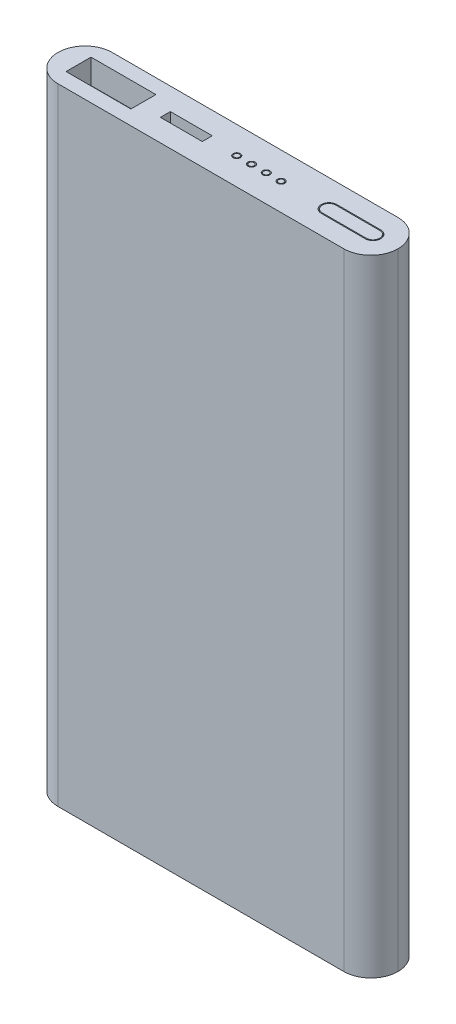
ISO-10303-21;
HEADER;
FILE_DESCRIPTION(('STEP AP214'),'2;1');
FILE_NAME('part.step','',(''),(''),'','','');
FILE_SCHEMA(('AUTOMOTIVE_DESIGN { 1 0 10303 214 1 1 1 1 }'));
ENDSEC;
DATA;
#1=APPLICATION_CONTEXT('core data for automotive mechanical design processes');
#2=APPLICATION_PROTOCOL_DEFINITION('international standard','automotive_design',2000,#1);
#3=PRODUCT_CONTEXT('',#1,'mechanical');
#4=PRODUCT('Part','Part','',(#3));
#5=PRODUCT_RELATED_PRODUCT_CATEGORY('part','',(#4));
#6=PRODUCT_DEFINITION_FORMATION('','',#4);
#7=PRODUCT_DEFINITION_CONTEXT('part definition',#1,'design');
#8=PRODUCT_DEFINITION('design','',#6,#7);
#9=PRODUCT_DEFINITION_SHAPE('','',#8);
#10=(LENGTH_UNIT() NAMED_UNIT(*) SI_UNIT(.MILLI.,.METRE.));
#11=(NAMED_UNIT(*) PLANE_ANGLE_UNIT() SI_UNIT($,.RADIAN.));
#12=(NAMED_UNIT(*) SI_UNIT($,.STERADIAN.) SOLID_ANGLE_UNIT());
#13=UNCERTAINTY_MEASURE_WITH_UNIT(LENGTH_MEASURE(1.E-05),#10,'distance_accuracy_value','');
#14=(GEOMETRIC_REPRESENTATION_CONTEXT(3) GLOBAL_UNCERTAINTY_ASSIGNED_CONTEXT((#13)) GLOBAL_UNIT_ASSIGNED_CONTEXT((#10,
#11,#12)) REPRESENTATION_CONTEXT('',''));
#15=CARTESIAN_POINT('',(0.,0.,0.));
#16=DIRECTION('',(0.,0.,1.));
#17=DIRECTION('',(1.,0.,0.));
#18=AXIS2_PLACEMENT_3D('',#15,#16,#17);
#19=CARTESIAN_POINT('',(0.,127.,0.));
#20=DIRECTION('',(0.,0.,-1.));
#21=DIRECTION('',(-1.,0.,0.));
#22=AXIS2_PLACEMENT_3D('',#19,#20,#21);
#23=PLANE('',#22);
#24=DIRECTION('',(1.,0.,0.));
#25=VECTOR('',#24,1.);
#26=CARTESIAN_POINT('',(0.,0.,0.));
#27=LINE('',#26,#25);
#28=CARTESIAN_POINT('',(5.5,0.,0.));
#29=VERTEX_POINT('',#28);
#30=CARTESIAN_POINT('',(63.5,0.,0.));
#31=VERTEX_POINT('',#30);
#32=EDGE_CURVE('E361',#29,#31,#27,.T.);
#33=ORIENTED_EDGE('',*,*,#32,.T.);
#34=DIRECTION('',(0.,-1.,0.));
#35=VECTOR('',#34,1.);
#36=CARTESIAN_POINT('',(63.5,127.,0.));
#37=LINE('',#36,#35);
#38=CARTESIAN_POINT('',(63.5,127.,0.));
#39=VERTEX_POINT('',#38);
#40=EDGE_CURVE('E376',#31,#39,#37,.F.);
#41=ORIENTED_EDGE('',*,*,#40,.T.);
#42=DIRECTION('',(1.,0.,0.));
#43=VECTOR('',#42,1.);
#44=CARTESIAN_POINT('',(0.,127.,0.));
#45=LINE('',#44,#43);
#46=CARTESIAN_POINT('',(5.5,127.,0.));
#47=VERTEX_POINT('',#46);
#48=EDGE_CURVE('E353',#47,#39,#45,.T.);
#49=ORIENTED_EDGE('',*,*,#48,.F.);
#50=DIRECTION('',(0.,-1.,0.));
#51=VECTOR('',#50,1.);
#52=CARTESIAN_POINT('',(5.5,127.,0.));
#53=LINE('',#52,#51);
#54=EDGE_CURVE('E374',#47,#29,#53,.T.);
#55=ORIENTED_EDGE('',*,*,#54,.T.);
#56=EDGE_LOOP('',(#33,#41,#49,#55));
#57=FACE_BOUND('',#56,.T.);
#58=ADVANCED_FACE('F34',(#57),#23,.F.);
#59=CARTESIAN_POINT('',(0.,127.,-11.));
#60=DIRECTION('',(0.,0.,1.));
#61=DIRECTION('',(1.,0.,0.));
#62=AXIS2_PLACEMENT_3D('',#59,#60,#61);
#63=PLANE('',#62);
#64=DIRECTION('',(-1.,0.,0.));
#65=VECTOR('',#64,1.);
#66=CARTESIAN_POINT('',(0.,127.,-11.));
#67=LINE('',#66,#65);
#68=CARTESIAN_POINT('',(63.5,127.,-11.));
#69=VERTEX_POINT('',#68);
#70=CARTESIAN_POINT('',(5.5,127.,-11.));
#71=VERTEX_POINT('',#70);
#72=EDGE_CURVE('E356',#69,#71,#67,.T.);
#73=ORIENTED_EDGE('',*,*,#72,.F.);
#74=DIRECTION('',(0.,-1.,0.));
#75=VECTOR('',#74,1.);
#76=CARTESIAN_POINT('',(63.5,127.,-11.));
#77=LINE('',#76,#75);
#78=CARTESIAN_POINT('',(63.5,0.,-11.));
#79=VERTEX_POINT('',#78);
#80=EDGE_CURVE('E11',#69,#79,#77,.T.);
#81=ORIENTED_EDGE('',*,*,#80,.T.);
#82=DIRECTION('',(-1.,0.,0.));
#83=VECTOR('',#82,1.);
#84=CARTESIAN_POINT('',(0.,0.,-11.));
#85=LINE('',#84,#83);
#86=CARTESIAN_POINT('',(5.5,0.,-11.));
#87=VERTEX_POINT('',#86);
#88=EDGE_CURVE('E357',#79,#87,#85,.T.);
#89=ORIENTED_EDGE('',*,*,#88,.T.);
#90=DIRECTION('',(0.,-1.,0.));
#91=VECTOR('',#90,1.);
#92=CARTESIAN_POINT('',(5.5,127.,-11.));
#93=LINE('',#92,#91);
#94=EDGE_CURVE('E43',#87,#71,#93,.F.);
#95=ORIENTED_EDGE('',*,*,#94,.T.);
#96=EDGE_LOOP('',(#73,#81,#89,#95));
#97=FACE_BOUND('',#96,.T.);
#98=ADVANCED_FACE('F417',(#97),#63,.F.);
#99=CARTESIAN_POINT('',(0.,127.,0.));
#100=DIRECTION('',(0.,-1.,0.));
#101=DIRECTION('',(0.,0.,-1.));
#102=AXIS2_PLACEMENT_3D('',#99,#100,#101);
#103=PLANE('',#102);
#104=DIRECTION('',(-1.,0.,0.));
#105=VECTOR('',#104,1.);
#106=CARTESIAN_POINT('',(4.17501881060618,127.,-8.03130060011561));
#107=LINE('',#106,#105);
#108=CARTESIAN_POINT('',(17.3377819312112,127.,-8.03130060011561));
#109=VERTEX_POINT('',#108);
#110=CARTESIAN_POINT('',(4.17501881060618,127.,-8.03130060011561));
#111=VERTEX_POINT('',#110);
#112=EDGE_CURVE('E251',#109,#111,#107,.T.);
#113=ORIENTED_EDGE('',*,*,#112,.F.);
#114=DIRECTION('',(0.,0.,-1.));
#115=VECTOR('',#114,1.);
#116=CARTESIAN_POINT('',(17.3377819312112,127.,-8.03130060011561));
#117=LINE('',#116,#115);
#118=CARTESIAN_POINT('',(17.3377819312112,127.,-2.96869939988432));
#119=VERTEX_POINT('',#118);
#120=EDGE_CURVE('E59',#119,#109,#117,.T.);
#121=ORIENTED_EDGE('',*,*,#120,.F.);
#122=DIRECTION('',(1.,0.,0.));
#123=VECTOR('',#122,1.);
#124=CARTESIAN_POINT('',(4.17501881060618,127.,-2.96869939988432));
#125=LINE('',#124,#123);
#126=CARTESIAN_POINT('',(4.17501881060618,127.,-2.96869939988432));
#127=VERTEX_POINT('',#126);
#128=EDGE_CURVE('E240',#127,#119,#125,.T.);
#129=ORIENTED_EDGE('',*,*,#128,.F.);
#130=DIRECTION('',(0.,0.,1.));
#131=VECTOR('',#130,1.);
#132=CARTESIAN_POINT('',(4.17501881060618,127.,-8.03130060011561));
#133=LINE('',#132,#131);
#134=EDGE_CURVE('E255',#111,#127,#133,.T.);
#135=ORIENTED_EDGE('',*,*,#134,.F.);
#136=EDGE_LOOP('',(#113,#121,#129,#135));
#137=FACE_BOUND('',#136,.T.);
#138=CARTESIAN_POINT('',(45.2719104200814,127.,-5.49999999999998));
#139=DIRECTION('',(0.,1.,0.));
#140=DIRECTION('',(0.,0.,1.));
#141=AXIS2_PLACEMENT_3D('',#138,#139,#140);
#142=CIRCLE('',#141,0.730138728586008);
#143=CARTESIAN_POINT('',(45.2719104200814,127.,-4.76986127141397));
#144=VERTEX_POINT('',#143);
#145=EDGE_CURVE('E235',#144,#144,#142,.T.);
#146=ORIENTED_EDGE('',*,*,#145,.F.);
#147=EDGE_LOOP('',(#146));
#148=FACE_BOUND('',#147,.T.);
#149=CARTESIAN_POINT('',(42.2719104200814,127.,-5.49999999999998));
#150=DIRECTION('',(0.,1.,0.));
#151=DIRECTION('',(0.,0.,1.));
#152=AXIS2_PLACEMENT_3D('',#149,#150,#151);
#153=CIRCLE('',#152,0.730138728586008);
#154=CARTESIAN_POINT('',(42.2719104200814,127.,-4.76986127141397));
#155=VERTEX_POINT('',#154);
#156=EDGE_CURVE('E271',#155,#155,#153,.T.);
#157=ORIENTED_EDGE('',*,*,#156,.F.);
#158=EDGE_LOOP('',(#157));
#159=FACE_BOUND('',#158,.T.);
#160=DIRECTION('',(-1.,0.,0.));
#161=VECTOR('',#160,1.);
#162=CARTESIAN_POINT('',(21.7928709874159,127.,-6.51252024004582));
#163=LINE('',#162,#161);
#164=CARTESIAN_POINT('',(30.2980410038069,127.,-6.51252024004582));
#165=VERTEX_POINT('',#164);
#166=CARTESIAN_POINT('',(21.7928709874159,127.,-6.51252024004582));
#167=VERTEX_POINT('',#166);
#168=EDGE_CURVE('E307',#165,#167,#163,.T.);
#169=ORIENTED_EDGE('',*,*,#168,.F.);
#170=DIRECTION('',(0.,0.,-1.));
#171=VECTOR('',#170,1.);
#172=CARTESIAN_POINT('',(30.2980410038069,127.,-6.51252024004582));
#173=LINE('',#172,#171);
#174=CARTESIAN_POINT('',(30.2980410038069,127.,-4.48747975995413));
#175=VERTEX_POINT('',#174);
#176=EDGE_CURVE('E305',#175,#165,#173,.T.);
#177=ORIENTED_EDGE('',*,*,#176,.F.);
#178=DIRECTION('',(1.,0.,0.));
#179=VECTOR('',#178,1.);
#180=CARTESIAN_POINT('',(21.7928709874159,127.,-4.48747975995413));
#181=LINE('',#180,#179);
#182=CARTESIAN_POINT('',(21.7928709874159,127.,-4.48747975995413));
#183=VERTEX_POINT('',#182);
#184=EDGE_CURVE('E295',#183,#175,#181,.T.);
#185=ORIENTED_EDGE('',*,*,#184,.F.);
#186=DIRECTION('',(0.,0.,1.));
#187=VECTOR('',#186,1.);
#188=CARTESIAN_POINT('',(21.7928709874159,127.,-6.51252024004582));
#189=LINE('',#188,#187);
#190=EDGE_CURVE('E311',#167,#183,#189,.T.);
#191=ORIENTED_EDGE('',*,*,#190,.F.);
#192=EDGE_LOOP('',(#169,#177,#185,#191));
#193=FACE_BOUND('',#192,.T.);
#194=DIRECTION('',(1.,0.,0.));
#195=VECTOR('',#194,1.);
#196=CARTESIAN_POINT('',(55.0035348609424,127.,-3.93059362792853));
#197=LINE('',#196,#195);
#198=CARTESIAN_POINT('',(55.0035348609424,127.,-3.93059362792853));
#199=VERTEX_POINT('',#198);
#200=CARTESIAN_POINT('',(63.9137129733519,127.,-3.93059362792853));
#201=VERTEX_POINT('',#200);
#202=EDGE_CURVE('E338',#199,#201,#197,.T.);
#203=ORIENTED_EDGE('',*,*,#202,.F.);
#204=CARTESIAN_POINT('',(55.0035348609424,127.,-5.49999999999999));
#205=DIRECTION('',(0.,1.,0.));
#206=DIRECTION('',(0.,0.,1.));
#207=AXIS2_PLACEMENT_3D('',#204,#205,#206);
#208=CIRCLE('',#207,1.56940637207146);
#209=CARTESIAN_POINT('',(55.0035348609424,127.,-7.06940637207145));
#210=VERTEX_POINT('',#209);
#211=EDGE_CURVE('E282',#210,#199,#208,.T.);
#212=ORIENTED_EDGE('',*,*,#211,.F.);
#213=DIRECTION('',(-1.,0.,0.));
#214=VECTOR('',#213,1.);
#215=CARTESIAN_POINT('',(55.0035348609424,127.,-7.06940637207145));
#216=LINE('',#215,#214);
#217=CARTESIAN_POINT('',(63.9137129733519,127.,-7.06940637207146));
#218=VERTEX_POINT('',#217);
#219=EDGE_CURVE('E327',#218,#210,#216,.T.);
#220=ORIENTED_EDGE('',*,*,#219,.F.);
#221=CARTESIAN_POINT('',(63.9137129733519,127.,-5.5));
#222=DIRECTION('',(0.,1.,0.));
#223=DIRECTION('',(0.,0.,1.));
#224=AXIS2_PLACEMENT_3D('',#221,#222,#223);
#225=CIRCLE('',#224,1.56940637207146);
#226=EDGE_CURVE('E341',#201,#218,#225,.T.);
#227=ORIENTED_EDGE('',*,*,#226,.F.);
#228=EDGE_LOOP('',(#203,#212,#220,#227));
#229=FACE_BOUND('',#228,.T.);
#230=CARTESIAN_POINT('',(36.2719104200814,127.,-5.49999999999998));
#231=DIRECTION('',(0.,1.,0.));
#232=DIRECTION('',(0.,0.,1.));
#233=AXIS2_PLACEMENT_3D('',#230,#231,#232);
#234=CIRCLE('',#233,0.730138728586008);
#235=CARTESIAN_POINT('',(36.2719104200814,127.,-4.76986127141397));
#236=VERTEX_POINT('',#235);
#237=EDGE_CURVE('E283',#236,#236,#234,.T.);
#238=ORIENTED_EDGE('',*,*,#237,.F.);
#239=EDGE_LOOP('',(#238));
#240=FACE_BOUND('',#239,.T.);
#241=CARTESIAN_POINT('',(39.2719104200814,127.,-5.49999999999998));
#242=DIRECTION('',(0.,1.,0.));
#243=DIRECTION('',(0.,0.,1.));
#244=AXIS2_PLACEMENT_3D('',#241,#242,#243);
#245=CIRCLE('',#244,0.730138728586008);
#246=CARTESIAN_POINT('',(39.2719104200814,127.,-4.76986127141397));
#247=VERTEX_POINT('',#246);
#248=EDGE_CURVE('E270',#247,#247,#245,.T.);
#249=ORIENTED_EDGE('',*,*,#248,.F.);
#250=EDGE_LOOP('',(#249));
#251=FACE_BOUND('',#250,.T.);
#252=ORIENTED_EDGE('',*,*,#48,.T.);
#253=CARTESIAN_POINT('',(63.5,127.,-5.5));
#254=DIRECTION('',(0.,-1.,0.));
#255=DIRECTION('',(0.,0.,-1.));
#256=AXIS2_PLACEMENT_3D('',#253,#254,#255);
#257=CIRCLE('',#256,5.5);
#258=CARTESIAN_POINT('',(69.,127.,-5.5));
#259=VERTEX_POINT('',#258);
#260=EDGE_CURVE('E385',#39,#259,#257,.F.);
#261=ORIENTED_EDGE('',*,*,#260,.T.);
#262=CARTESIAN_POINT('',(63.5,127.,-5.5));
#263=DIRECTION('',(0.,-1.,0.));
#264=DIRECTION('',(0.,0.,-1.));
#265=AXIS2_PLACEMENT_3D('',#262,#263,#264);
#266=CIRCLE('',#265,5.5);
#267=EDGE_CURVE('E383',#259,#69,#266,.F.);
#268=ORIENTED_EDGE('',*,*,#267,.T.);
#269=ORIENTED_EDGE('',*,*,#72,.T.);
#270=CARTESIAN_POINT('',(5.5,127.,-5.5));
#271=DIRECTION('',(0.,-1.,0.));
#272=DIRECTION('',(0.,0.,-1.));
#273=AXIS2_PLACEMENT_3D('',#270,#271,#272);
#274=CIRCLE('',#273,5.5);
#275=CARTESIAN_POINT('',(0.,127.,-5.5));
#276=VERTEX_POINT('',#275);
#277=EDGE_CURVE('E381',#71,#276,#274,.F.);
#278=ORIENTED_EDGE('',*,*,#277,.T.);
#279=CARTESIAN_POINT('',(5.5,127.,-5.5));
#280=DIRECTION('',(0.,-1.,0.));
#281=DIRECTION('',(0.,0.,-1.));
#282=AXIS2_PLACEMENT_3D('',#279,#280,#281);
#283=CIRCLE('',#282,5.5);
#284=EDGE_CURVE('E379',#276,#47,#283,.F.);
#285=ORIENTED_EDGE('',*,*,#284,.T.);
#286=EDGE_LOOP('',(#252,#261,#268,#269,#278,#285));
#287=FACE_BOUND('',#286,.T.);
#288=ADVANCED_FACE('F404',(#137,#148,#159,#193,#229,#240,#251,#287),#103,.F.);
#289=CARTESIAN_POINT('',(0.,0.,0.));
#290=DIRECTION('',(0.,-1.,0.));
#291=DIRECTION('',(0.,0.,-1.));
#292=AXIS2_PLACEMENT_3D('',#289,#290,#291);
#293=PLANE('',#292);
#294=CARTESIAN_POINT('',(63.5,0.,-5.5));
#295=DIRECTION('',(0.,-1.,0.));
#296=DIRECTION('',(0.,0.,-1.));
#297=AXIS2_PLACEMENT_3D('',#294,#295,#296);
#298=CIRCLE('',#297,5.5);
#299=CARTESIAN_POINT('',(69.,0.,-5.5));
#300=VERTEX_POINT('',#299);
#301=EDGE_CURVE('E370',#79,#300,#298,.T.);
#302=ORIENTED_EDGE('',*,*,#301,.T.);
#303=CARTESIAN_POINT('',(63.5,0.,-5.5));
#304=DIRECTION('',(0.,-1.,0.));
#305=DIRECTION('',(0.,0.,-1.));
#306=AXIS2_PLACEMENT_3D('',#303,#304,#305);
#307=CIRCLE('',#306,5.5);
#308=EDGE_CURVE('E372',#300,#31,#307,.T.);
#309=ORIENTED_EDGE('',*,*,#308,.T.);
#310=ORIENTED_EDGE('',*,*,#32,.F.);
#311=CARTESIAN_POINT('',(5.5,0.,-5.5));
#312=DIRECTION('',(0.,-1.,0.));
#313=DIRECTION('',(0.,0.,-1.));
#314=AXIS2_PLACEMENT_3D('',#311,#312,#313);
#315=CIRCLE('',#314,5.5);
#316=CARTESIAN_POINT('',(0.,0.,-5.5));
#317=VERTEX_POINT('',#316);
#318=EDGE_CURVE('E360',#29,#317,#315,.T.);
#319=ORIENTED_EDGE('',*,*,#318,.T.);
#320=CARTESIAN_POINT('',(5.5,0.,-5.5));
#321=DIRECTION('',(0.,-1.,0.));
#322=DIRECTION('',(0.,0.,-1.));
#323=AXIS2_PLACEMENT_3D('',#320,#321,#322);
#324=CIRCLE('',#323,5.5);
#325=EDGE_CURVE('E368',#317,#87,#324,.T.);
#326=ORIENTED_EDGE('',*,*,#325,.T.);
#327=ORIENTED_EDGE('',*,*,#88,.F.);
#328=EDGE_LOOP('',(#302,#309,#310,#319,#326,#327));
#329=FACE_BOUND('',#328,.T.);
#330=ADVANCED_FACE('F419',(#329),#293,.T.);
#331=CARTESIAN_POINT('',(63.5,127.,-5.5));
#332=DIRECTION('',(0.,-1.,0.));
#333=DIRECTION('',(0.,0.,-1.));
#334=AXIS2_PLACEMENT_3D('',#331,#332,#333);
#335=CYLINDRICAL_SURFACE('',#334,5.5);
#336=ORIENTED_EDGE('',*,*,#80,.F.);
#337=ORIENTED_EDGE('',*,*,#267,.F.);
#338=DIRECTION('',(0.,-1.,0.));
#339=VECTOR('',#338,1.);
#340=CARTESIAN_POINT('',(69.,127.,-5.5));
#341=LINE('',#340,#339);
#342=EDGE_CURVE('E364',#300,#259,#341,.F.);
#343=ORIENTED_EDGE('',*,*,#342,.F.);
#344=ORIENTED_EDGE('',*,*,#301,.F.);
#345=EDGE_LOOP('',(#336,#337,#343,#344));
#346=FACE_BOUND('',#345,.T.);
#347=ADVANCED_FACE('F413',(#346),#335,.T.);
#348=CARTESIAN_POINT('',(63.5,127.,-5.5));
#349=DIRECTION('',(0.,-1.,0.));
#350=DIRECTION('',(0.,0.,-1.));
#351=AXIS2_PLACEMENT_3D('',#348,#349,#350);
#352=CYLINDRICAL_SURFACE('',#351,5.5);
#353=ORIENTED_EDGE('',*,*,#260,.F.);
#354=ORIENTED_EDGE('',*,*,#40,.F.);
#355=ORIENTED_EDGE('',*,*,#308,.F.);
#356=ORIENTED_EDGE('',*,*,#342,.T.);
#357=EDGE_LOOP('',(#353,#354,#355,#356));
#358=FACE_BOUND('',#357,.T.);
#359=ADVANCED_FACE('F408',(#358),#352,.T.);
#360=CARTESIAN_POINT('',(5.5,127.,-5.5));
#361=DIRECTION('',(0.,-1.,0.));
#362=DIRECTION('',(0.,0.,-1.));
#363=AXIS2_PLACEMENT_3D('',#360,#361,#362);
#364=CYLINDRICAL_SURFACE('',#363,5.5);
#365=ORIENTED_EDGE('',*,*,#54,.F.);
#366=ORIENTED_EDGE('',*,*,#284,.F.);
#367=DIRECTION('',(0.,-1.,0.));
#368=VECTOR('',#367,1.);
#369=CARTESIAN_POINT('',(0.,127.,-5.5));
#370=LINE('',#369,#368);
#371=EDGE_CURVE('E38',#317,#276,#370,.F.);
#372=ORIENTED_EDGE('',*,*,#371,.F.);
#373=ORIENTED_EDGE('',*,*,#318,.F.);
#374=EDGE_LOOP('',(#365,#366,#372,#373));
#375=FACE_BOUND('',#374,.T.);
#376=ADVANCED_FACE('F36',(#375),#364,.T.);
#377=CARTESIAN_POINT('',(5.5,127.,-5.5));
#378=DIRECTION('',(0.,-1.,0.));
#379=DIRECTION('',(0.,0.,-1.));
#380=AXIS2_PLACEMENT_3D('',#377,#378,#379);
#381=CYLINDRICAL_SURFACE('',#380,5.5);
#382=ORIENTED_EDGE('',*,*,#277,.F.);
#383=ORIENTED_EDGE('',*,*,#94,.F.);
#384=ORIENTED_EDGE('',*,*,#325,.F.);
#385=ORIENTED_EDGE('',*,*,#371,.T.);
#386=EDGE_LOOP('',(#382,#383,#384,#385));
#387=FACE_BOUND('',#386,.T.);
#388=ADVANCED_FACE('F396',(#387),#381,.T.);
#389=CARTESIAN_POINT('',(39.2719104200814,122.,-5.49999999999998));
#390=DIRECTION('',(0.,1.,0.));
#391=DIRECTION('',(0.,0.,1.));
#392=AXIS2_PLACEMENT_3D('',#389,#390,#391);
#393=CYLINDRICAL_SURFACE('',#392,0.730138728586008);
#394=CARTESIAN_POINT('',(39.2719104200814,122.,-5.49999999999998));
#395=DIRECTION('',(0.,1.,0.));
#396=DIRECTION('',(0.,0.,1.));
#397=AXIS2_PLACEMENT_3D('',#394,#395,#396);
#398=CIRCLE('',#397,0.730138728586008);
#399=CARTESIAN_POINT('',(39.2719104200814,122.,-4.76986127141397));
#400=VERTEX_POINT('',#399);
#401=EDGE_CURVE('E286',#400,#400,#398,.T.);
#402=ORIENTED_EDGE('',*,*,#401,.F.);
#403=EDGE_LOOP('',(#402));
#404=FACE_BOUND('',#403,.T.);
#405=ORIENTED_EDGE('',*,*,#248,.T.);
#406=EDGE_LOOP('',(#405));
#407=FACE_BOUND('',#406,.T.);
#408=ADVANCED_FACE('F438',(#404,#407),#393,.F.);
#409=CARTESIAN_POINT('',(39.2719104200814,122.,-5.49999999999998));
#410=DIRECTION('',(0.,1.,0.));
#411=DIRECTION('',(0.,0.,1.));
#412=AXIS2_PLACEMENT_3D('',#409,#410,#411);
#413=PLANE('',#412);
#414=CARTESIAN_POINT('',(39.2719104200814,122.,-5.49999999999998));
#415=DIRECTION('',(0.,1.,0.));
#416=DIRECTION('',(0.,0.,1.));
#417=AXIS2_PLACEMENT_3D('',#414,#415,#416);
#418=CIRCLE('',#417,0.530138728586012);
#419=CARTESIAN_POINT('',(39.2719104200814,122.,-4.96986127141397));
#420=VERTEX_POINT('',#419);
#421=EDGE_CURVE('E222',#420,#420,#418,.T.);
#422=ORIENTED_EDGE('',*,*,#421,.F.);
#423=EDGE_LOOP('',(#422));
#424=FACE_BOUND('',#423,.T.);
#425=ORIENTED_EDGE('',*,*,#401,.T.);
#426=EDGE_LOOP('',(#425));
#427=FACE_BOUND('',#426,.T.);
#428=ADVANCED_FACE('F443',(#424,#427),#413,.T.);
#429=CARTESIAN_POINT('',(36.2719104200814,122.,-5.49999999999998));
#430=DIRECTION('',(0.,1.,0.));
#431=DIRECTION('',(0.,0.,1.));
#432=AXIS2_PLACEMENT_3D('',#429,#430,#431);
#433=CYLINDRICAL_SURFACE('',#432,0.730138728586008);
#434=CARTESIAN_POINT('',(36.2719104200814,122.,-5.49999999999998));
#435=DIRECTION('',(0.,1.,0.));
#436=DIRECTION('',(0.,0.,1.));
#437=AXIS2_PLACEMENT_3D('',#434,#435,#436);
#438=CIRCLE('',#437,0.730138728586008);
#439=CARTESIAN_POINT('',(36.2719104200814,122.,-4.76986127141397));
#440=VERTEX_POINT('',#439);
#441=EDGE_CURVE('E279',#440,#440,#438,.T.);
#442=ORIENTED_EDGE('',*,*,#441,.F.);
#443=EDGE_LOOP('',(#442));
#444=FACE_BOUND('',#443,.T.);
#445=ORIENTED_EDGE('',*,*,#237,.T.);
#446=EDGE_LOOP('',(#445));
#447=FACE_BOUND('',#446,.T.);
#448=ADVANCED_FACE('F491',(#444,#447),#433,.F.);
#449=CARTESIAN_POINT('',(36.2719104200814,122.,-5.49999999999998));
#450=DIRECTION('',(0.,1.,0.));
#451=DIRECTION('',(0.,0.,1.));
#452=AXIS2_PLACEMENT_3D('',#449,#450,#451);
#453=PLANE('',#452);
#454=CARTESIAN_POINT('',(36.2719104200814,122.,-5.49999999999998));
#455=DIRECTION('',(0.,1.,0.));
#456=DIRECTION('',(0.,0.,1.));
#457=AXIS2_PLACEMENT_3D('',#454,#455,#456);
#458=CIRCLE('',#457,0.530138728586012);
#459=CARTESIAN_POINT('',(36.2719104200814,122.,-4.96986127141397));
#460=VERTEX_POINT('',#459);
#461=EDGE_CURVE('E229',#460,#460,#458,.T.);
#462=ORIENTED_EDGE('',*,*,#461,.F.);
#463=EDGE_LOOP('',(#462));
#464=FACE_BOUND('',#463,.T.);
#465=ORIENTED_EDGE('',*,*,#441,.T.);
#466=EDGE_LOOP('',(#465));
#467=FACE_BOUND('',#466,.T.);
#468=ADVANCED_FACE('F496',(#464,#467),#453,.T.);
#469=CARTESIAN_POINT('',(55.0035348609424,122.,-5.49999999999999));
#470=DIRECTION('',(0.,1.,0.));
#471=DIRECTION('',(0.,0.,1.));
#472=AXIS2_PLACEMENT_3D('',#469,#470,#471);
#473=CYLINDRICAL_SURFACE('',#472,1.56940637207146);
#474=ORIENTED_EDGE('',*,*,#211,.T.);
#475=DIRECTION('',(0.,1.,0.));
#476=VECTOR('',#475,1.);
#477=CARTESIAN_POINT('',(55.0035348609424,122.,-3.93059362792853));
#478=LINE('',#477,#476);
#479=CARTESIAN_POINT('',(55.0035348609424,122.,-3.93059362792853));
#480=VERTEX_POINT('',#479);
#481=EDGE_CURVE('E336',#480,#199,#478,.T.);
#482=ORIENTED_EDGE('',*,*,#481,.F.);
#483=CARTESIAN_POINT('',(55.0035348609424,122.,-5.49999999999999));
#484=DIRECTION('',(0.,1.,0.));
#485=DIRECTION('',(0.,0.,1.));
#486=AXIS2_PLACEMENT_3D('',#483,#484,#485);
#487=CIRCLE('',#486,1.56940637207146);
#488=CARTESIAN_POINT('',(55.0035348609424,122.,-7.06940637207145));
#489=VERTEX_POINT('',#488);
#490=EDGE_CURVE('E323',#489,#480,#487,.T.);
#491=ORIENTED_EDGE('',*,*,#490,.F.);
#492=DIRECTION('',(0.,1.,0.));
#493=VECTOR('',#492,1.);
#494=CARTESIAN_POINT('',(55.0035348609424,122.,-7.06940637207145));
#495=LINE('',#494,#493);
#496=EDGE_CURVE('E308',#489,#210,#495,.T.);
#497=ORIENTED_EDGE('',*,*,#496,.T.);
#498=EDGE_LOOP('',(#474,#482,#491,#497));
#499=FACE_BOUND('',#498,.T.);
#500=ADVANCED_FACE('F504',(#499),#473,.F.);
#501=CARTESIAN_POINT('',(55.0035348609424,122.,-7.06940637207145));
#502=DIRECTION('',(0.,0.,-1.));
#503=DIRECTION('',(-1.,0.,0.));
#504=AXIS2_PLACEMENT_3D('',#501,#502,#503);
#505=PLANE('',#504);
#506=ORIENTED_EDGE('',*,*,#219,.T.);
#507=ORIENTED_EDGE('',*,*,#496,.F.);
#508=DIRECTION('',(-1.,0.,0.));
#509=VECTOR('',#508,1.);
#510=CARTESIAN_POINT('',(55.0035348609424,122.,-7.06940637207145));
#511=LINE('',#510,#509);
#512=CARTESIAN_POINT('',(63.9137129733519,122.,-7.06940637207146));
#513=VERTEX_POINT('',#512);
#514=EDGE_CURVE('E333',#513,#489,#511,.T.);
#515=ORIENTED_EDGE('',*,*,#514,.F.);
#516=DIRECTION('',(0.,1.,0.));
#517=VECTOR('',#516,1.);
#518=CARTESIAN_POINT('',(63.9137129733519,122.,-7.06940637207146));
#519=LINE('',#518,#517);
#520=EDGE_CURVE('E347',#513,#218,#519,.T.);
#521=ORIENTED_EDGE('',*,*,#520,.T.);
#522=EDGE_LOOP('',(#506,#507,#515,#521));
#523=FACE_BOUND('',#522,.T.);
#524=ADVANCED_FACE('F509',(#523),#505,.F.);
#525=CARTESIAN_POINT('',(63.9137129733519,122.,-5.5));
#526=DIRECTION('',(0.,1.,0.));
#527=DIRECTION('',(0.,0.,1.));
#528=AXIS2_PLACEMENT_3D('',#525,#526,#527);
#529=CYLINDRICAL_SURFACE('',#528,1.56940637207146);
#530=ORIENTED_EDGE('',*,*,#226,.T.);
#531=ORIENTED_EDGE('',*,*,#520,.F.);
#532=CARTESIAN_POINT('',(63.9137129733519,122.,-5.5));
#533=DIRECTION('',(0.,1.,0.));
#534=DIRECTION('',(0.,0.,1.));
#535=AXIS2_PLACEMENT_3D('',#532,#533,#534);
#536=CIRCLE('',#535,1.56940637207146);
#537=CARTESIAN_POINT('',(63.9137129733519,122.,-3.93059362792853));
#538=VERTEX_POINT('',#537);
#539=EDGE_CURVE('E330',#538,#513,#536,.T.);
#540=ORIENTED_EDGE('',*,*,#539,.F.);
#541=DIRECTION('',(0.,1.,0.));
#542=VECTOR('',#541,1.);
#543=CARTESIAN_POINT('',(63.9137129733519,122.,-3.93059362792853));
#544=LINE('',#543,#542);
#545=EDGE_CURVE('E349',#538,#201,#544,.T.);
#546=ORIENTED_EDGE('',*,*,#545,.T.);
#547=EDGE_LOOP('',(#530,#531,#540,#546));
#548=FACE_BOUND('',#547,.T.);
#549=ADVANCED_FACE('F519',(#548),#529,.F.);
#550=CARTESIAN_POINT('',(55.0035348609424,122.,-3.93059362792853));
#551=DIRECTION('',(0.,0.,1.));
#552=DIRECTION('',(1.,0.,0.));
#553=AXIS2_PLACEMENT_3D('',#550,#551,#552);
#554=PLANE('',#553);
#555=ORIENTED_EDGE('',*,*,#202,.T.);
#556=ORIENTED_EDGE('',*,*,#545,.F.);
#557=DIRECTION('',(1.,0.,0.));
#558=VECTOR('',#557,1.);
#559=CARTESIAN_POINT('',(55.0035348609424,122.,-3.93059362792853));
#560=LINE('',#559,#558);
#561=EDGE_CURVE('E326',#480,#538,#560,.T.);
#562=ORIENTED_EDGE('',*,*,#561,.F.);
#563=ORIENTED_EDGE('',*,*,#481,.T.);
#564=EDGE_LOOP('',(#555,#556,#562,#563));
#565=FACE_BOUND('',#564,.T.);
#566=ADVANCED_FACE('F529',(#565),#554,.F.);
#567=CARTESIAN_POINT('',(55.0035348609424,122.,-5.49999999999999));
#568=DIRECTION('',(0.,1.,0.));
#569=DIRECTION('',(0.,0.,1.));
#570=AXIS2_PLACEMENT_3D('',#567,#568,#569);
#571=PLANE('',#570);
#572=CARTESIAN_POINT('',(55.0035348609424,122.,-5.49999999999999));
#573=DIRECTION('',(0.,1.,0.));
#574=DIRECTION('',(0.,0.,1.));
#575=AXIS2_PLACEMENT_3D('',#572,#573,#574);
#576=CIRCLE('',#575,1.36940637207146);
#577=CARTESIAN_POINT('',(55.0035348609424,122.,-6.86940637207145));
#578=VERTEX_POINT('',#577);
#579=CARTESIAN_POINT('',(55.0035348609424,122.,-4.13059362792853));
#580=VERTEX_POINT('',#579);
#581=EDGE_CURVE('E200',#578,#580,#576,.T.);
#582=ORIENTED_EDGE('',*,*,#581,.F.);
#583=DIRECTION('',(-1.,0.,0.));
#584=VECTOR('',#583,1.);
#585=CARTESIAN_POINT('',(63.9137129733519,122.,-6.86940637207146));
#586=LINE('',#585,#584);
#587=CARTESIAN_POINT('',(63.9137129733519,122.,-6.86940637207146));
#588=VERTEX_POINT('',#587);
#589=EDGE_CURVE('E51',#588,#578,#586,.T.);
#590=ORIENTED_EDGE('',*,*,#589,.F.);
#591=CARTESIAN_POINT('',(63.9137129733519,122.,-5.5));
#592=DIRECTION('',(0.,1.,0.));
#593=DIRECTION('',(0.,0.,1.));
#594=AXIS2_PLACEMENT_3D('',#591,#592,#593);
#595=CIRCLE('',#594,1.36940637207146);
#596=CARTESIAN_POINT('',(63.9137129733519,122.,-4.13059362792853));
#597=VERTEX_POINT('',#596);
#598=EDGE_CURVE('E209',#597,#588,#595,.T.);
#599=ORIENTED_EDGE('',*,*,#598,.F.);
#600=DIRECTION('',(1.,0.,0.));
#601=VECTOR('',#600,1.);
#602=CARTESIAN_POINT('',(55.0035348609424,122.,-4.13059362792853));
#603=LINE('',#602,#601);
#604=EDGE_CURVE('E191',#580,#597,#603,.T.);
#605=ORIENTED_EDGE('',*,*,#604,.F.);
#606=EDGE_LOOP('',(#582,#590,#599,#605));
#607=FACE_BOUND('',#606,.T.);
#608=ORIENTED_EDGE('',*,*,#490,.T.);
#609=ORIENTED_EDGE('',*,*,#561,.T.);
#610=ORIENTED_EDGE('',*,*,#539,.T.);
#611=ORIENTED_EDGE('',*,*,#514,.T.);
#612=EDGE_LOOP('',(#608,#609,#610,#611));
#613=FACE_BOUND('',#612,.T.);
#614=ADVANCED_FACE('F206',(#607,#613),#571,.T.);
#615=CARTESIAN_POINT('',(30.2980410038069,122.,-6.51252024004582));
#616=DIRECTION('',(1.,0.,0.));
#617=DIRECTION('',(0.,0.,-1.));
#618=AXIS2_PLACEMENT_3D('',#615,#616,#617);
#619=PLANE('',#618);
#620=ORIENTED_EDGE('',*,*,#176,.T.);
#621=DIRECTION('',(0.,1.,0.));
#622=VECTOR('',#621,1.);
#623=CARTESIAN_POINT('',(30.2980410038069,122.,-6.51252024004582));
#624=LINE('',#623,#622);
#625=CARTESIAN_POINT('',(30.2980410038069,122.,-6.51252024004582));
#626=VERTEX_POINT('',#625);
#627=EDGE_CURVE('E304',#626,#165,#624,.T.);
#628=ORIENTED_EDGE('',*,*,#627,.F.);
#629=DIRECTION('',(0.,0.,-1.));
#630=VECTOR('',#629,1.);
#631=CARTESIAN_POINT('',(30.2980410038069,122.,-6.51252024004582));
#632=LINE('',#631,#630);
#633=CARTESIAN_POINT('',(30.2980410038069,122.,-4.48747975995413));
#634=VERTEX_POINT('',#633);
#635=EDGE_CURVE('E291',#634,#626,#632,.T.);
#636=ORIENTED_EDGE('',*,*,#635,.F.);
#637=DIRECTION('',(0.,1.,0.));
#638=VECTOR('',#637,1.);
#639=CARTESIAN_POINT('',(30.2980410038069,122.,-4.48747975995413));
#640=LINE('',#639,#638);
#641=EDGE_CURVE('E252',#634,#175,#640,.T.);
#642=ORIENTED_EDGE('',*,*,#641,.T.);
#643=EDGE_LOOP('',(#620,#628,#636,#642));
#644=FACE_BOUND('',#643,.T.);
#645=ADVANCED_FACE('F546',(#644),#619,.F.);
#646=CARTESIAN_POINT('',(21.7928709874159,122.,-4.48747975995413));
#647=DIRECTION('',(0.,0.,1.));
#648=DIRECTION('',(1.,0.,0.));
#649=AXIS2_PLACEMENT_3D('',#646,#647,#648);
#650=PLANE('',#649);
#651=ORIENTED_EDGE('',*,*,#184,.T.);
#652=ORIENTED_EDGE('',*,*,#641,.F.);
#653=DIRECTION('',(1.,0.,0.));
#654=VECTOR('',#653,1.);
#655=CARTESIAN_POINT('',(21.7928709874159,122.,-4.48747975995413));
#656=LINE('',#655,#654);
#657=CARTESIAN_POINT('',(21.7928709874159,122.,-4.48747975995413));
#658=VERTEX_POINT('',#657);
#659=EDGE_CURVE('E301',#658,#634,#656,.T.);
#660=ORIENTED_EDGE('',*,*,#659,.F.);
#661=DIRECTION('',(0.,1.,0.));
#662=VECTOR('',#661,1.);
#663=CARTESIAN_POINT('',(21.7928709874159,122.,-4.48747975995413));
#664=LINE('',#663,#662);
#665=EDGE_CURVE('E317',#658,#183,#664,.T.);
#666=ORIENTED_EDGE('',*,*,#665,.T.);
#667=EDGE_LOOP('',(#651,#652,#660,#666));
#668=FACE_BOUND('',#667,.T.);
#669=ADVANCED_FACE('F551',(#668),#650,.F.);
#670=CARTESIAN_POINT('',(21.7928709874159,122.,-6.51252024004582));
#671=DIRECTION('',(-1.,0.,0.));
#672=DIRECTION('',(0.,0.,1.));
#673=AXIS2_PLACEMENT_3D('',#670,#671,#672);
#674=PLANE('',#673);
#675=ORIENTED_EDGE('',*,*,#190,.T.);
#676=ORIENTED_EDGE('',*,*,#665,.F.);
#677=DIRECTION('',(0.,0.,1.));
#678=VECTOR('',#677,1.);
#679=CARTESIAN_POINT('',(21.7928709874159,122.,-6.51252024004582));
#680=LINE('',#679,#678);
#681=CARTESIAN_POINT('',(21.7928709874159,122.,-6.51252024004582));
#682=VERTEX_POINT('',#681);
#683=EDGE_CURVE('E298',#682,#658,#680,.T.);
#684=ORIENTED_EDGE('',*,*,#683,.F.);
#685=DIRECTION('',(0.,1.,0.));
#686=VECTOR('',#685,1.);
#687=CARTESIAN_POINT('',(21.7928709874159,122.,-6.51252024004582));
#688=LINE('',#687,#686);
#689=EDGE_CURVE('E319',#682,#167,#688,.T.);
#690=ORIENTED_EDGE('',*,*,#689,.T.);
#691=EDGE_LOOP('',(#675,#676,#684,#690));
#692=FACE_BOUND('',#691,.T.);
#693=ADVANCED_FACE('F561',(#692),#674,.F.);
#694=CARTESIAN_POINT('',(21.7928709874159,122.,-6.51252024004582));
#695=DIRECTION('',(0.,0.,-1.));
#696=DIRECTION('',(-1.,0.,0.));
#697=AXIS2_PLACEMENT_3D('',#694,#695,#696);
#698=PLANE('',#697);
#699=ORIENTED_EDGE('',*,*,#168,.T.);
#700=ORIENTED_EDGE('',*,*,#689,.F.);
#701=DIRECTION('',(-1.,0.,0.));
#702=VECTOR('',#701,1.);
#703=CARTESIAN_POINT('',(21.7928709874159,122.,-6.51252024004582));
#704=LINE('',#703,#702);
#705=EDGE_CURVE('E294',#626,#682,#704,.T.);
#706=ORIENTED_EDGE('',*,*,#705,.F.);
#707=ORIENTED_EDGE('',*,*,#627,.T.);
#708=EDGE_LOOP('',(#699,#700,#706,#707));
#709=FACE_BOUND('',#708,.T.);
#710=ADVANCED_FACE('F571',(#709),#698,.F.);
#711=CARTESIAN_POINT('',(0.,122.,0.));
#712=DIRECTION('',(0.,1.,0.));
#713=DIRECTION('',(0.,0.,1.));
#714=AXIS2_PLACEMENT_3D('',#711,#712,#713);
#715=PLANE('',#714);
#716=ORIENTED_EDGE('',*,*,#635,.T.);
#717=ORIENTED_EDGE('',*,*,#705,.T.);
#718=ORIENTED_EDGE('',*,*,#683,.T.);
#719=ORIENTED_EDGE('',*,*,#659,.T.);
#720=EDGE_LOOP('',(#716,#717,#718,#719));
#721=FACE_BOUND('',#720,.T.);
#722=ADVANCED_FACE('F581',(#721),#715,.T.);
#723=CARTESIAN_POINT('',(42.2719104200814,122.,-5.49999999999998));
#724=DIRECTION('',(0.,1.,0.));
#725=DIRECTION('',(0.,0.,1.));
#726=AXIS2_PLACEMENT_3D('',#723,#724,#725);
#727=CYLINDRICAL_SURFACE('',#726,0.730138728586008);
#728=CARTESIAN_POINT('',(42.2719104200814,122.,-5.49999999999998));
#729=DIRECTION('',(0.,1.,0.));
#730=DIRECTION('',(0.,0.,1.));
#731=AXIS2_PLACEMENT_3D('',#728,#729,#730);
#732=CIRCLE('',#731,0.730138728586008);
#733=CARTESIAN_POINT('',(42.2719104200814,122.,-4.76986127141397));
#734=VERTEX_POINT('',#733);
#735=EDGE_CURVE('E267',#734,#734,#732,.T.);
#736=ORIENTED_EDGE('',*,*,#735,.F.);
#737=EDGE_LOOP('',(#736));
#738=FACE_BOUND('',#737,.T.);
#739=ORIENTED_EDGE('',*,*,#156,.T.);
#740=EDGE_LOOP('',(#739));
#741=FACE_BOUND('',#740,.T.);
#742=ADVANCED_FACE('F591',(#738,#741),#727,.F.);
#743=CARTESIAN_POINT('',(42.2719104200814,122.,-5.49999999999998));
#744=DIRECTION('',(0.,1.,0.));
#745=DIRECTION('',(0.,0.,1.));
#746=AXIS2_PLACEMENT_3D('',#743,#744,#745);
#747=PLANE('',#746);
#748=CARTESIAN_POINT('',(42.2719104200814,122.,-5.49999999999998));
#749=DIRECTION('',(0.,1.,0.));
#750=DIRECTION('',(0.,0.,1.));
#751=AXIS2_PLACEMENT_3D('',#748,#749,#750);
#752=CIRCLE('',#751,0.530138728586012);
#753=CARTESIAN_POINT('',(42.2719104200814,122.,-4.96986127141397));
#754=VERTEX_POINT('',#753);
#755=EDGE_CURVE('E832',#754,#754,#752,.T.);
#756=ORIENTED_EDGE('',*,*,#755,.F.);
#757=EDGE_LOOP('',(#756));
#758=FACE_BOUND('',#757,.T.);
#759=ORIENTED_EDGE('',*,*,#735,.T.);
#760=EDGE_LOOP('',(#759));
#761=FACE_BOUND('',#760,.T.);
#762=ADVANCED_FACE('F601',(#758,#761),#747,.T.);
#763=CARTESIAN_POINT('',(45.2719104200814,122.,-5.49999999999998));
#764=DIRECTION('',(0.,1.,0.));
#765=DIRECTION('',(0.,0.,1.));
#766=AXIS2_PLACEMENT_3D('',#763,#764,#765);
#767=CYLINDRICAL_SURFACE('',#766,0.730138728586008);
#768=CARTESIAN_POINT('',(45.2719104200814,122.,-5.49999999999998));
#769=DIRECTION('',(0.,1.,0.));
#770=DIRECTION('',(0.,0.,1.));
#771=AXIS2_PLACEMENT_3D('',#768,#769,#770);
#772=CIRCLE('',#771,0.730138728586008);
#773=CARTESIAN_POINT('',(45.2719104200814,122.,-4.76986127141397));
#774=VERTEX_POINT('',#773);
#775=EDGE_CURVE('E274',#774,#774,#772,.T.);
#776=ORIENTED_EDGE('',*,*,#775,.F.);
#777=EDGE_LOOP('',(#776));
#778=FACE_BOUND('',#777,.T.);
#779=ORIENTED_EDGE('',*,*,#145,.T.);
#780=EDGE_LOOP('',(#779));
#781=FACE_BOUND('',#780,.T.);
#782=ADVANCED_FACE('F609',(#778,#781),#767,.F.);
#783=CARTESIAN_POINT('',(45.2719104200814,122.,-5.49999999999998));
#784=DIRECTION('',(0.,1.,0.));
#785=DIRECTION('',(0.,0.,1.));
#786=AXIS2_PLACEMENT_3D('',#783,#784,#785);
#787=PLANE('',#786);
#788=CARTESIAN_POINT('',(45.2719104200814,122.,-5.49999999999998));
#789=DIRECTION('',(0.,1.,0.));
#790=DIRECTION('',(0.,0.,1.));
#791=AXIS2_PLACEMENT_3D('',#788,#789,#790);
#792=CIRCLE('',#791,0.530138728586012);
#793=CARTESIAN_POINT('',(45.2719104200814,122.,-4.96986127141397));
#794=VERTEX_POINT('',#793);
#795=EDGE_CURVE('E833',#794,#794,#792,.T.);
#796=ORIENTED_EDGE('',*,*,#795,.F.);
#797=EDGE_LOOP('',(#796));
#798=FACE_BOUND('',#797,.T.);
#799=ORIENTED_EDGE('',*,*,#775,.T.);
#800=EDGE_LOOP('',(#799));
#801=FACE_BOUND('',#800,.T.);
#802=ADVANCED_FACE('F614',(#798,#801),#787,.T.);
#803=CARTESIAN_POINT('',(17.3377819312112,122.,-8.03130060011561));
#804=DIRECTION('',(1.,0.,0.));
#805=DIRECTION('',(0.,0.,-1.));
#806=AXIS2_PLACEMENT_3D('',#803,#804,#805);
#807=PLANE('',#806);
#808=ORIENTED_EDGE('',*,*,#120,.T.);
#809=DIRECTION('',(0.,1.,0.));
#810=VECTOR('',#809,1.);
#811=CARTESIAN_POINT('',(17.3377819312112,122.,-8.03130060011561));
#812=LINE('',#811,#810);
#813=CARTESIAN_POINT('',(17.3377819312112,122.,-8.03130060011561));
#814=VERTEX_POINT('',#813);
#815=EDGE_CURVE('E249',#814,#109,#812,.T.);
#816=ORIENTED_EDGE('',*,*,#815,.F.);
#817=DIRECTION('',(0.,0.,-1.));
#818=VECTOR('',#817,1.);
#819=CARTESIAN_POINT('',(17.3377819312112,122.,-8.03130060011561));
#820=LINE('',#819,#818);
#821=CARTESIAN_POINT('',(17.3377819312112,122.,-2.96869939988432));
#822=VERTEX_POINT('',#821);
#823=EDGE_CURVE('E236',#822,#814,#820,.T.);
#824=ORIENTED_EDGE('',*,*,#823,.F.);
#825=DIRECTION('',(0.,1.,0.));
#826=VECTOR('',#825,1.);
#827=CARTESIAN_POINT('',(17.3377819312112,122.,-2.96869939988432));
#828=LINE('',#827,#826);
#829=EDGE_CURVE('E260',#822,#119,#828,.T.);
#830=ORIENTED_EDGE('',*,*,#829,.T.);
#831=EDGE_LOOP('',(#808,#816,#824,#830));
#832=FACE_BOUND('',#831,.T.);
#833=ADVANCED_FACE('F622',(#832),#807,.F.);
#834=CARTESIAN_POINT('',(4.17501881060618,122.,-2.96869939988432));
#835=DIRECTION('',(0.,0.,1.));
#836=DIRECTION('',(1.,0.,0.));
#837=AXIS2_PLACEMENT_3D('',#834,#835,#836);
#838=PLANE('',#837);
#839=ORIENTED_EDGE('',*,*,#128,.T.);
#840=ORIENTED_EDGE('',*,*,#829,.F.);
#841=DIRECTION('',(1.,0.,0.));
#842=VECTOR('',#841,1.);
#843=CARTESIAN_POINT('',(4.17501881060618,122.,-2.96869939988432));
#844=LINE('',#843,#842);
#845=CARTESIAN_POINT('',(4.17501881060618,122.,-2.96869939988432));
#846=VERTEX_POINT('',#845);
#847=EDGE_CURVE('E246',#846,#822,#844,.T.);
#848=ORIENTED_EDGE('',*,*,#847,.F.);
#849=DIRECTION('',(0.,1.,0.));
#850=VECTOR('',#849,1.);
#851=CARTESIAN_POINT('',(4.17501881060618,122.,-2.96869939988432));
#852=LINE('',#851,#850);
#853=EDGE_CURVE('E262',#846,#127,#852,.T.);
#854=ORIENTED_EDGE('',*,*,#853,.T.);
#855=EDGE_LOOP('',(#839,#840,#848,#854));
#856=FACE_BOUND('',#855,.T.);
#857=ADVANCED_FACE('F627',(#856),#838,.F.);
#858=CARTESIAN_POINT('',(4.17501881060618,122.,-8.03130060011561));
#859=DIRECTION('',(-1.,0.,0.));
#860=DIRECTION('',(0.,0.,1.));
#861=AXIS2_PLACEMENT_3D('',#858,#859,#860);
#862=PLANE('',#861);
#863=ORIENTED_EDGE('',*,*,#134,.T.);
#864=ORIENTED_EDGE('',*,*,#853,.F.);
#865=DIRECTION('',(0.,0.,1.));
#866=VECTOR('',#865,1.);
#867=CARTESIAN_POINT('',(4.17501881060618,122.,-8.03130060011561));
#868=LINE('',#867,#866);
#869=CARTESIAN_POINT('',(4.17501881060618,122.,-8.03130060011561));
#870=VERTEX_POINT('',#869);
#871=EDGE_CURVE('E243',#870,#846,#868,.T.);
#872=ORIENTED_EDGE('',*,*,#871,.F.);
#873=DIRECTION('',(0.,1.,0.));
#874=VECTOR('',#873,1.);
#875=CARTESIAN_POINT('',(4.17501881060618,122.,-8.03130060011561));
#876=LINE('',#875,#874);
#877=EDGE_CURVE('E264',#870,#111,#876,.T.);
#878=ORIENTED_EDGE('',*,*,#877,.T.);
#879=EDGE_LOOP('',(#863,#864,#872,#878));
#880=FACE_BOUND('',#879,.T.);
#881=ADVANCED_FACE('F636',(#880),#862,.F.);
#882=CARTESIAN_POINT('',(4.17501881060618,122.,-8.03130060011561));
#883=DIRECTION('',(0.,0.,-1.));
#884=DIRECTION('',(-1.,0.,0.));
#885=AXIS2_PLACEMENT_3D('',#882,#883,#884);
#886=PLANE('',#885);
#887=ORIENTED_EDGE('',*,*,#112,.T.);
#888=ORIENTED_EDGE('',*,*,#877,.F.);
#889=DIRECTION('',(-1.,0.,0.));
#890=VECTOR('',#889,1.);
#891=CARTESIAN_POINT('',(4.17501881060618,122.,-8.03130060011561));
#892=LINE('',#891,#890);
#893=EDGE_CURVE('E239',#814,#870,#892,.T.);
#894=ORIENTED_EDGE('',*,*,#893,.F.);
#895=ORIENTED_EDGE('',*,*,#815,.T.);
#896=EDGE_LOOP('',(#887,#888,#894,#895));
#897=FACE_BOUND('',#896,.T.);
#898=ADVANCED_FACE('F646',(#897),#886,.F.);
#899=CARTESIAN_POINT('',(0.,122.,0.));
#900=DIRECTION('',(0.,1.,0.));
#901=DIRECTION('',(0.,0.,1.));
#902=AXIS2_PLACEMENT_3D('',#899,#900,#901);
#903=PLANE('',#902);
#904=ORIENTED_EDGE('',*,*,#823,.T.);
#905=ORIENTED_EDGE('',*,*,#893,.T.);
#906=ORIENTED_EDGE('',*,*,#871,.T.);
#907=ORIENTED_EDGE('',*,*,#847,.T.);
#908=EDGE_LOOP('',(#904,#905,#906,#907));
#909=FACE_BOUND('',#908,.T.);
#910=ADVANCED_FACE('F656',(#909),#903,.T.);
#911=CARTESIAN_POINT('',(36.2719104200814,138.96662371864,-5.49999999999998));
#912=DIRECTION('',(0.,-1.,0.));
#913=DIRECTION('',(0.,0.,-1.));
#914=AXIS2_PLACEMENT_3D('',#911,#912,#913);
#915=CYLINDRICAL_SURFACE('',#914,0.530138728586012);
#916=CARTESIAN_POINT('',(36.2719104200814,127.,-5.49999999999998));
#917=DIRECTION('',(0.,-1.,0.));
#918=DIRECTION('',(0.,0.,-1.));
#919=AXIS2_PLACEMENT_3D('',#916,#917,#918);
#920=CIRCLE('',#919,0.530138728586012);
#921=CARTESIAN_POINT('',(36.2719104200814,127.,-6.03013872858599));
#922=VERTEX_POINT('',#921);
#923=EDGE_CURVE('E232',#922,#922,#920,.T.);
#924=ORIENTED_EDGE('',*,*,#923,.T.);
#925=EDGE_LOOP('',(#924));
#926=FACE_BOUND('',#925,.T.);
#927=ORIENTED_EDGE('',*,*,#461,.T.);
#928=EDGE_LOOP('',(#927));
#929=FACE_BOUND('',#928,.T.);
#930=ADVANCED_FACE('F666',(#926,#929),#915,.T.);
#931=CARTESIAN_POINT('',(0.,127.,0.));
#932=DIRECTION('',(0.,-1.,0.));
#933=DIRECTION('',(0.,0.,-1.));
#934=AXIS2_PLACEMENT_3D('',#931,#932,#933);
#935=PLANE('',#934);
#936=ORIENTED_EDGE('',*,*,#923,.F.);
#937=EDGE_LOOP('',(#936));
#938=FACE_BOUND('',#937,.T.);
#939=ADVANCED_FACE('F710',(#938),#935,.F.);
#940=CARTESIAN_POINT('',(39.2719104200814,138.96662371864,-5.49999999999998));
#941=DIRECTION('',(0.,-1.,0.));
#942=DIRECTION('',(0.,0.,-1.));
#943=AXIS2_PLACEMENT_3D('',#940,#941,#942);
#944=CYLINDRICAL_SURFACE('',#943,0.530138728586012);
#945=CARTESIAN_POINT('',(39.2719104200814,127.,-5.49999999999998));
#946=DIRECTION('',(0.,-1.,0.));
#947=DIRECTION('',(0.,0.,-1.));
#948=AXIS2_PLACEMENT_3D('',#945,#946,#947);
#949=CIRCLE('',#948,0.530138728586012);
#950=CARTESIAN_POINT('',(39.2719104200814,127.,-6.03013872858599));
#951=VERTEX_POINT('',#950);
#952=EDGE_CURVE('E225',#951,#951,#949,.T.);
#953=ORIENTED_EDGE('',*,*,#952,.T.);
#954=EDGE_LOOP('',(#953));
#955=FACE_BOUND('',#954,.T.);
#956=ORIENTED_EDGE('',*,*,#421,.T.);
#957=EDGE_LOOP('',(#956));
#958=FACE_BOUND('',#957,.T.);
#959=ADVANCED_FACE('F720',(#955,#958),#944,.T.);
#960=CARTESIAN_POINT('',(0.,127.,0.));
#961=DIRECTION('',(0.,-1.,0.));
#962=DIRECTION('',(0.,0.,-1.));
#963=AXIS2_PLACEMENT_3D('',#960,#961,#962);
#964=PLANE('',#963);
#965=ORIENTED_EDGE('',*,*,#952,.F.);
#966=EDGE_LOOP('',(#965));
#967=FACE_BOUND('',#966,.T.);
#968=ADVANCED_FACE('F730',(#967),#964,.F.);
#969=CARTESIAN_POINT('',(63.9137129733519,138.96662371864,-6.86940637207146));
#970=DIRECTION('',(0.,0.,1.));
#971=DIRECTION('',(1.,0.,0.));
#972=AXIS2_PLACEMENT_3D('',#969,#970,#971);
#973=PLANE('',#972);
#974=DIRECTION('',(0.,-1.,0.));
#975=VECTOR('',#974,1.);
#976=CARTESIAN_POINT('',(55.0035348609424,138.96662371864,-6.86940637207145));
#977=LINE('',#976,#975);
#978=CARTESIAN_POINT('',(55.0035348609424,127.,-6.86940637207145));
#979=VERTEX_POINT('',#978);
#980=EDGE_CURVE('E202',#979,#578,#977,.T.);
#981=ORIENTED_EDGE('',*,*,#980,.F.);
#982=DIRECTION('',(1.,0.,0.));
#983=VECTOR('',#982,1.);
#984=CARTESIAN_POINT('',(63.9137129733519,127.,-6.86940637207146));
#985=LINE('',#984,#983);
#986=CARTESIAN_POINT('',(63.9137129733519,127.,-6.86940637207146));
#987=VERTEX_POINT('',#986);
#988=EDGE_CURVE('E196',#979,#987,#985,.T.);
#989=ORIENTED_EDGE('',*,*,#988,.T.);
#990=DIRECTION('',(0.,-1.,0.));
#991=VECTOR('',#990,1.);
#992=CARTESIAN_POINT('',(63.9137129733519,138.96662371864,-6.86940637207146));
#993=LINE('',#992,#991);
#994=EDGE_CURVE('E216',#987,#588,#993,.T.);
#995=ORIENTED_EDGE('',*,*,#994,.T.);
#996=ORIENTED_EDGE('',*,*,#589,.T.);
#997=EDGE_LOOP('',(#981,#989,#995,#996));
#998=FACE_BOUND('',#997,.T.);
#999=ADVANCED_FACE('F740',(#998),#973,.F.);
#1000=CARTESIAN_POINT('',(63.9137129733519,138.96662371864,-5.5));
#1001=DIRECTION('',(0.,-1.,0.));
#1002=DIRECTION('',(0.,0.,-1.));
#1003=AXIS2_PLACEMENT_3D('',#1000,#1001,#1002);
#1004=CYLINDRICAL_SURFACE('',#1003,1.36940637207146);
#1005=ORIENTED_EDGE('',*,*,#994,.F.);
#1006=CARTESIAN_POINT('',(63.9137129733519,127.,-5.5));
#1007=DIRECTION('',(0.,-1.,0.));
#1008=DIRECTION('',(0.,0.,-1.));
#1009=AXIS2_PLACEMENT_3D('',#1006,#1007,#1008);
#1010=CIRCLE('',#1009,1.36940637207146);
#1011=CARTESIAN_POINT('',(63.9137129733519,127.,-4.13059362792853));
#1012=VERTEX_POINT('',#1011);
#1013=EDGE_CURVE('E221',#987,#1012,#1010,.T.);
#1014=ORIENTED_EDGE('',*,*,#1013,.T.);
#1015=DIRECTION('',(0.,-1.,0.));
#1016=VECTOR('',#1015,1.);
#1017=CARTESIAN_POINT('',(63.9137129733519,138.96662371864,-4.13059362792853));
#1018=LINE('',#1017,#1016);
#1019=EDGE_CURVE('E197',#1012,#597,#1018,.T.);
#1020=ORIENTED_EDGE('',*,*,#1019,.T.);
#1021=ORIENTED_EDGE('',*,*,#598,.T.);
#1022=EDGE_LOOP('',(#1005,#1014,#1020,#1021));
#1023=FACE_BOUND('',#1022,.T.);
#1024=ADVANCED_FACE('F750',(#1023),#1004,.T.);
#1025=CARTESIAN_POINT('',(55.0035348609424,138.96662371864,-4.13059362792853));
#1026=DIRECTION('',(0.,0.,-1.));
#1027=DIRECTION('',(-1.,0.,0.));
#1028=AXIS2_PLACEMENT_3D('',#1025,#1026,#1027);
#1029=PLANE('',#1028);
#1030=ORIENTED_EDGE('',*,*,#1019,.F.);
#1031=DIRECTION('',(-1.,0.,0.));
#1032=VECTOR('',#1031,1.);
#1033=CARTESIAN_POINT('',(55.0035348609424,127.,-4.13059362792853));
#1034=LINE('',#1033,#1032);
#1035=CARTESIAN_POINT('',(55.0035348609424,127.,-4.13059362792853));
#1036=VERTEX_POINT('',#1035);
#1037=EDGE_CURVE('E193',#1012,#1036,#1034,.T.);
#1038=ORIENTED_EDGE('',*,*,#1037,.T.);
#1039=DIRECTION('',(0.,-1.,0.));
#1040=VECTOR('',#1039,1.);
#1041=CARTESIAN_POINT('',(55.0035348609424,138.96662371864,-4.13059362792853));
#1042=LINE('',#1041,#1040);
#1043=EDGE_CURVE('E186',#1036,#580,#1042,.T.);
#1044=ORIENTED_EDGE('',*,*,#1043,.T.);
#1045=ORIENTED_EDGE('',*,*,#604,.T.);
#1046=EDGE_LOOP('',(#1030,#1038,#1044,#1045));
#1047=FACE_BOUND('',#1046,.T.);
#1048=ADVANCED_FACE('F189',(#1047),#1029,.F.);
#1049=CARTESIAN_POINT('',(55.0035348609424,138.96662371864,-5.49999999999999));
#1050=DIRECTION('',(0.,-1.,0.));
#1051=DIRECTION('',(0.,0.,-1.));
#1052=AXIS2_PLACEMENT_3D('',#1049,#1050,#1051);
#1053=CYLINDRICAL_SURFACE('',#1052,1.36940637207146);
#1054=ORIENTED_EDGE('',*,*,#1043,.F.);
#1055=CARTESIAN_POINT('',(55.0035348609424,127.,-5.49999999999999));
#1056=DIRECTION('',(0.,-1.,0.));
#1057=DIRECTION('',(0.,0.,-1.));
#1058=AXIS2_PLACEMENT_3D('',#1055,#1056,#1057);
#1059=CIRCLE('',#1058,1.36940637207146);
#1060=EDGE_CURVE('E226',#1036,#979,#1059,.T.);
#1061=ORIENTED_EDGE('',*,*,#1060,.T.);
#1062=ORIENTED_EDGE('',*,*,#980,.T.);
#1063=ORIENTED_EDGE('',*,*,#581,.T.);
#1064=EDGE_LOOP('',(#1054,#1061,#1062,#1063));
#1065=FACE_BOUND('',#1064,.T.);
#1066=ADVANCED_FACE('F201',(#1065),#1053,.T.);
#1067=CARTESIAN_POINT('',(0.,127.,0.));
#1068=DIRECTION('',(0.,-1.,0.));
#1069=DIRECTION('',(0.,0.,-1.));
#1070=AXIS2_PLACEMENT_3D('',#1067,#1068,#1069);
#1071=PLANE('',#1070);
#1072=ORIENTED_EDGE('',*,*,#1037,.F.);
#1073=ORIENTED_EDGE('',*,*,#1013,.F.);
#1074=ORIENTED_EDGE('',*,*,#988,.F.);
#1075=ORIENTED_EDGE('',*,*,#1060,.F.);
#1076=EDGE_LOOP('',(#1072,#1073,#1074,#1075));
#1077=FACE_BOUND('',#1076,.T.);
#1078=ADVANCED_FACE('F776',(#1077),#1071,.F.);
#1079=CARTESIAN_POINT('',(42.2719104200814,138.96662371864,-5.49999999999998));
#1080=DIRECTION('',(0.,-1.,0.));
#1081=DIRECTION('',(0.,0.,-1.));
#1082=AXIS2_PLACEMENT_3D('',#1079,#1080,#1081);
#1083=CYLINDRICAL_SURFACE('',#1082,0.530138728586012);
#1084=CARTESIAN_POINT('',(42.2719104200814,127.,-5.49999999999998));
#1085=DIRECTION('',(0.,-1.,0.));
#1086=DIRECTION('',(0.,0.,-1.));
#1087=AXIS2_PLACEMENT_3D('',#1084,#1085,#1086);
#1088=CIRCLE('',#1087,0.530138728586012);
#1089=CARTESIAN_POINT('',(42.2719104200814,127.,-6.03013872858599));
#1090=VERTEX_POINT('',#1089);
#1091=EDGE_CURVE('E204',#1090,#1090,#1088,.T.);
#1092=ORIENTED_EDGE('',*,*,#1091,.T.);
#1093=EDGE_LOOP('',(#1092));
#1094=FACE_BOUND('',#1093,.T.);
#1095=ORIENTED_EDGE('',*,*,#755,.T.);
#1096=EDGE_LOOP('',(#1095));
#1097=FACE_BOUND('',#1096,.T.);
#1098=ADVANCED_FACE('F785',(#1094,#1097),#1083,.T.);
#1099=CARTESIAN_POINT('',(0.,127.,0.));
#1100=DIRECTION('',(0.,-1.,0.));
#1101=DIRECTION('',(0.,0.,-1.));
#1102=AXIS2_PLACEMENT_3D('',#1099,#1100,#1101);
#1103=PLANE('',#1102);
#1104=ORIENTED_EDGE('',*,*,#1091,.F.);
#1105=EDGE_LOOP('',(#1104));
#1106=FACE_BOUND('',#1105,.T.);
#1107=ADVANCED_FACE('F795',(#1106),#1103,.F.);
#1108=CARTESIAN_POINT('',(45.2719104200814,138.96662371864,-5.49999999999998));
#1109=DIRECTION('',(0.,-1.,0.));
#1110=DIRECTION('',(0.,0.,-1.));
#1111=AXIS2_PLACEMENT_3D('',#1108,#1109,#1110);
#1112=CYLINDRICAL_SURFACE('',#1111,0.530138728586012);
#1113=CARTESIAN_POINT('',(45.2719104200814,127.,-5.49999999999998));
#1114=DIRECTION('',(0.,-1.,0.));
#1115=DIRECTION('',(0.,0.,-1.));
#1116=AXIS2_PLACEMENT_3D('',#1113,#1114,#1115);
#1117=CIRCLE('',#1116,0.530138728586012);
#1118=CARTESIAN_POINT('',(45.2719104200814,127.,-6.03013872858599));
#1119=VERTEX_POINT('',#1118);
#1120=EDGE_CURVE('E831',#1119,#1119,#1117,.T.);
#1121=ORIENTED_EDGE('',*,*,#1120,.T.);
#1122=EDGE_LOOP('',(#1121));
#1123=FACE_BOUND('',#1122,.T.);
#1124=ORIENTED_EDGE('',*,*,#795,.T.);
#1125=EDGE_LOOP('',(#1124));
#1126=FACE_BOUND('',#1125,.T.);
#1127=ADVANCED_FACE('F805',(#1123,#1126),#1112,.T.);
#1128=CARTESIAN_POINT('',(0.,127.,0.));
#1129=DIRECTION('',(0.,-1.,0.));
#1130=DIRECTION('',(0.,0.,-1.));
#1131=AXIS2_PLACEMENT_3D('',#1128,#1129,#1130);
#1132=PLANE('',#1131);
#1133=ORIENTED_EDGE('',*,*,#1120,.F.);
#1134=EDGE_LOOP('',(#1133));
#1135=FACE_BOUND('',#1134,.T.);
#1136=ADVANCED_FACE('F815',(#1135),#1132,.F.);
#1137=CLOSED_SHELL('',(#58,#98,#288,#330,#347,#359,#376,#388,#408,#428,#448,#468,#500,#524,#549,
#566,#614,#645,#669,#693,#710,#722,#742,#762,#782,#802,#833,#857,#881,#898,#910,#930,#939,#959,
#968,#999,#1024,#1048,#1066,#1078,#1098,#1107,#1127,#1136));
#1138=MANIFOLD_SOLID_BREP('B2',#1137);
#1139=ADVANCED_BREP_SHAPE_REPRESENTATION('',(#18,#1138),#14);
#1140=SHAPE_DEFINITION_REPRESENTATION(#9,#1139);
ENDSEC;
END-ISO-10303-21;
